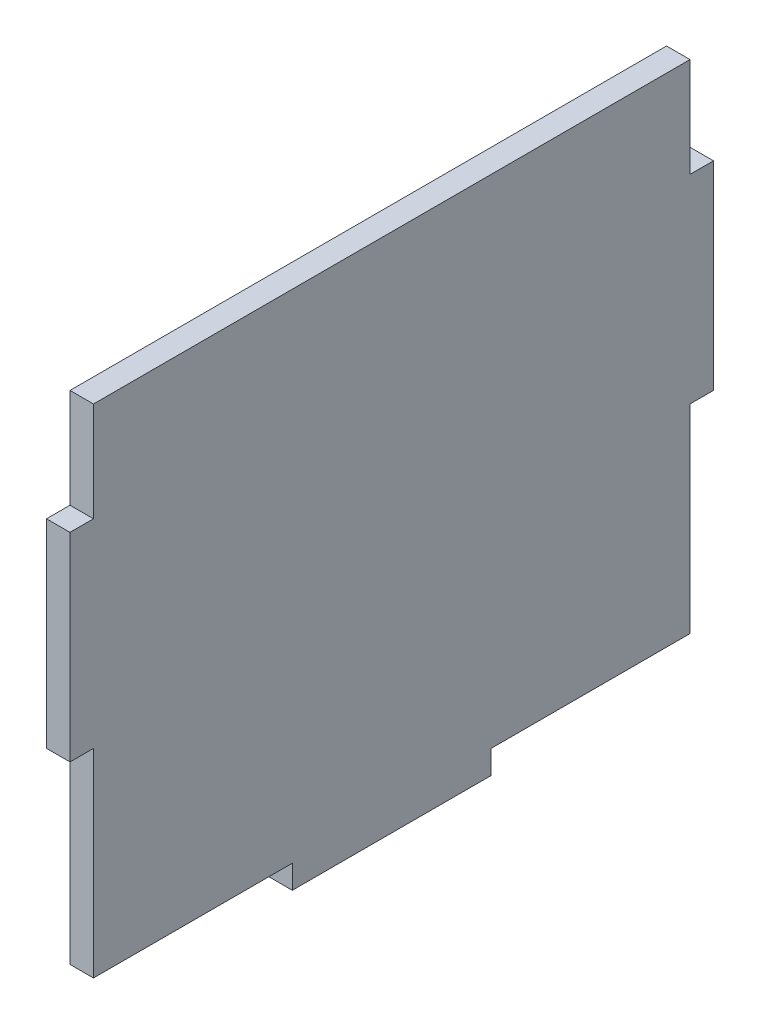
ISO-10303-21;
HEADER;
FILE_DESCRIPTION(('STEP AP214'),'2;1');
FILE_NAME('part.step','',(''),(''),'','','');
FILE_SCHEMA(('AUTOMOTIVE_DESIGN { 1 0 10303 214 1 1 1 1 }'));
ENDSEC;
DATA;
#1=APPLICATION_CONTEXT('core data for automotive mechanical design processes');
#2=APPLICATION_PROTOCOL_DEFINITION('international standard','automotive_design',2000,#1);
#3=PRODUCT_CONTEXT('',#1,'mechanical');
#4=PRODUCT('Part','Part','',(#3));
#5=PRODUCT_RELATED_PRODUCT_CATEGORY('part','',(#4));
#6=PRODUCT_DEFINITION_FORMATION('','',#4);
#7=PRODUCT_DEFINITION_CONTEXT('part definition',#1,'design');
#8=PRODUCT_DEFINITION('design','',#6,#7);
#9=PRODUCT_DEFINITION_SHAPE('','',#8);
#10=(LENGTH_UNIT() NAMED_UNIT(*) SI_UNIT(.MILLI.,.METRE.));
#11=(NAMED_UNIT(*) PLANE_ANGLE_UNIT() SI_UNIT($,.RADIAN.));
#12=(NAMED_UNIT(*) SI_UNIT($,.STERADIAN.) SOLID_ANGLE_UNIT());
#13=UNCERTAINTY_MEASURE_WITH_UNIT(LENGTH_MEASURE(1.E-05),#10,'distance_accuracy_value','');
#14=(GEOMETRIC_REPRESENTATION_CONTEXT(3) GLOBAL_UNCERTAINTY_ASSIGNED_CONTEXT((#13)) GLOBAL_UNIT_ASSIGNED_CONTEXT((#10,
#11,#12)) REPRESENTATION_CONTEXT('',''));
#15=CARTESIAN_POINT('',(0.,0.,0.));
#16=DIRECTION('',(0.,0.,1.));
#17=DIRECTION('',(1.,0.,0.));
#18=AXIS2_PLACEMENT_3D('',#15,#16,#17);
#19=CARTESIAN_POINT('',(3.,31.75,38.1));
#20=DIRECTION('',(0.,0.,-1.));
#21=DIRECTION('',(-1.,0.,0.));
#22=AXIS2_PLACEMENT_3D('',#19,#20,#21);
#23=PLANE('',#22);
#24=DIRECTION('',(0.,-1.,0.));
#25=VECTOR('',#24,1.);
#26=CARTESIAN_POINT('',(0.,31.75,38.1));
#27=LINE('',#26,#25);
#28=CARTESIAN_POINT('',(0.,31.75,38.1));
#29=VERTEX_POINT('',#28);
#30=CARTESIAN_POINT('',(0.,19.05,38.1));
#31=VERTEX_POINT('',#30);
#32=EDGE_CURVE('E177',#29,#31,#27,.T.);
#33=ORIENTED_EDGE('',*,*,#32,.T.);
#34=DIRECTION('',(-1.,0.,0.));
#35=VECTOR('',#34,1.);
#36=CARTESIAN_POINT('',(3.,19.05,38.1));
#37=LINE('',#36,#35);
#38=CARTESIAN_POINT('',(3.,19.05,38.1));
#39=VERTEX_POINT('',#38);
#40=EDGE_CURVE('E11',#39,#31,#37,.T.);
#41=ORIENTED_EDGE('',*,*,#40,.F.);
#42=DIRECTION('',(0.,-1.,0.));
#43=VECTOR('',#42,1.);
#44=CARTESIAN_POINT('',(3.,31.75,38.1));
#45=LINE('',#44,#43);
#46=CARTESIAN_POINT('',(3.,31.75,38.1));
#47=VERTEX_POINT('',#46);
#48=EDGE_CURVE('E209',#47,#39,#45,.T.);
#49=ORIENTED_EDGE('',*,*,#48,.F.);
#50=DIRECTION('',(-1.,0.,0.));
#51=VECTOR('',#50,1.);
#52=CARTESIAN_POINT('',(3.,31.75,38.1));
#53=LINE('',#52,#51);
#54=EDGE_CURVE('E173',#47,#29,#53,.T.);
#55=ORIENTED_EDGE('',*,*,#54,.T.);
#56=EDGE_LOOP('',(#33,#41,#49,#55));
#57=FACE_BOUND('',#56,.T.);
#58=ADVANCED_FACE('F33',(#57),#23,.F.);
#59=CARTESIAN_POINT('',(3.,19.05,38.1));
#60=DIRECTION('',(0.,-1.,0.));
#61=DIRECTION('',(0.,0.,-1.));
#62=AXIS2_PLACEMENT_3D('',#59,#60,#61);
#63=PLANE('',#62);
#64=DIRECTION('',(0.,0.,1.));
#65=VECTOR('',#64,1.);
#66=CARTESIAN_POINT('',(0.,19.05,38.1));
#67=LINE('',#66,#65);
#68=CARTESIAN_POINT('',(0.,19.05,41.1));
#69=VERTEX_POINT('',#68);
#70=EDGE_CURVE('E180',#31,#69,#67,.T.);
#71=ORIENTED_EDGE('',*,*,#70,.T.);
#72=DIRECTION('',(-1.,0.,0.));
#73=VECTOR('',#72,1.);
#74=CARTESIAN_POINT('',(3.,19.05,41.1));
#75=LINE('',#74,#73);
#76=CARTESIAN_POINT('',(3.,19.05,41.1));
#77=VERTEX_POINT('',#76);
#78=EDGE_CURVE('E41',#77,#69,#75,.T.);
#79=ORIENTED_EDGE('',*,*,#78,.F.);
#80=DIRECTION('',(0.,0.,1.));
#81=VECTOR('',#80,1.);
#82=CARTESIAN_POINT('',(3.,19.05,38.1));
#83=LINE('',#82,#81);
#84=EDGE_CURVE('E116',#39,#77,#83,.T.);
#85=ORIENTED_EDGE('',*,*,#84,.F.);
#86=ORIENTED_EDGE('',*,*,#40,.T.);
#87=EDGE_LOOP('',(#71,#79,#85,#86));
#88=FACE_BOUND('',#87,.T.);
#89=ADVANCED_FACE('F306',(#88),#63,.F.);
#90=CARTESIAN_POINT('',(3.,19.05,41.1));
#91=DIRECTION('',(0.,0.,-1.));
#92=DIRECTION('',(-1.,0.,0.));
#93=AXIS2_PLACEMENT_3D('',#90,#91,#92);
#94=PLANE('',#93);
#95=DIRECTION('',(0.,-1.,0.));
#96=VECTOR('',#95,1.);
#97=CARTESIAN_POINT('',(0.,19.05,41.1));
#98=LINE('',#97,#96);
#99=CARTESIAN_POINT('',(0.,-6.35,41.1));
#100=VERTEX_POINT('',#99);
#101=EDGE_CURVE('E182',#69,#100,#98,.T.);
#102=ORIENTED_EDGE('',*,*,#101,.T.);
#103=DIRECTION('',(-1.,0.,0.));
#104=VECTOR('',#103,1.);
#105=CARTESIAN_POINT('',(3.,-6.35,41.1));
#106=LINE('',#105,#104);
#107=CARTESIAN_POINT('',(3.,-6.35,41.1));
#108=VERTEX_POINT('',#107);
#109=EDGE_CURVE('E240',#108,#100,#106,.T.);
#110=ORIENTED_EDGE('',*,*,#109,.F.);
#111=DIRECTION('',(0.,-1.,0.));
#112=VECTOR('',#111,1.);
#113=CARTESIAN_POINT('',(3.,19.05,41.1));
#114=LINE('',#113,#112);
#115=EDGE_CURVE('E248',#77,#108,#114,.T.);
#116=ORIENTED_EDGE('',*,*,#115,.F.);
#117=ORIENTED_EDGE('',*,*,#78,.T.);
#118=EDGE_LOOP('',(#102,#110,#116,#117));
#119=FACE_BOUND('',#118,.T.);
#120=ADVANCED_FACE('F246',(#119),#94,.F.);
#121=CARTESIAN_POINT('',(3.,-6.35,38.1));
#122=DIRECTION('',(0.,1.,0.));
#123=DIRECTION('',(0.,0.,1.));
#124=AXIS2_PLACEMENT_3D('',#121,#122,#123);
#125=PLANE('',#124);
#126=DIRECTION('',(0.,0.,-1.));
#127=VECTOR('',#126,1.);
#128=CARTESIAN_POINT('',(0.,-6.35,38.1));
#129=LINE('',#128,#127);
#130=CARTESIAN_POINT('',(0.,-6.35,38.1));
#131=VERTEX_POINT('',#130);
#132=EDGE_CURVE('E184',#100,#131,#129,.T.);
#133=ORIENTED_EDGE('',*,*,#132,.T.);
#134=DIRECTION('',(-1.,0.,0.));
#135=VECTOR('',#134,1.);
#136=CARTESIAN_POINT('',(3.,-6.35,38.1));
#137=LINE('',#136,#135);
#138=CARTESIAN_POINT('',(3.,-6.35,38.1));
#139=VERTEX_POINT('',#138);
#140=EDGE_CURVE('E237',#139,#131,#137,.T.);
#141=ORIENTED_EDGE('',*,*,#140,.F.);
#142=DIRECTION('',(0.,0.,-1.));
#143=VECTOR('',#142,1.);
#144=CARTESIAN_POINT('',(3.,-6.35,38.1));
#145=LINE('',#144,#143);
#146=EDGE_CURVE('E265',#108,#139,#145,.T.);
#147=ORIENTED_EDGE('',*,*,#146,.F.);
#148=ORIENTED_EDGE('',*,*,#109,.T.);
#149=EDGE_LOOP('',(#133,#141,#147,#148));
#150=FACE_BOUND('',#149,.T.);
#151=ADVANCED_FACE('F256',(#150),#125,.F.);
#152=CARTESIAN_POINT('',(3.,-20.8153,38.1));
#153=DIRECTION('',(0.,0.,-1.));
#154=DIRECTION('',(0.,1.,0.));
#155=AXIS2_PLACEMENT_3D('',#152,#153,#154);
#156=PLANE('',#155);
#157=DIRECTION('',(0.,-1.,0.));
#158=VECTOR('',#157,1.);
#159=CARTESIAN_POINT('',(0.,-20.8153,38.1));
#160=LINE('',#159,#158);
#161=CARTESIAN_POINT('',(0.,-31.75,38.1));
#162=VERTEX_POINT('',#161);
#163=EDGE_CURVE('E187',#131,#162,#160,.T.);
#164=ORIENTED_EDGE('',*,*,#163,.T.);
#165=DIRECTION('',(-1.,0.,0.));
#166=VECTOR('',#165,1.);
#167=CARTESIAN_POINT('',(3.,-31.75,38.1));
#168=LINE('',#167,#166);
#169=CARTESIAN_POINT('',(3.,-31.75,38.1));
#170=VERTEX_POINT('',#169);
#171=EDGE_CURVE('E234',#170,#162,#168,.T.);
#172=ORIENTED_EDGE('',*,*,#171,.F.);
#173=DIRECTION('',(0.,-1.,0.));
#174=VECTOR('',#173,1.);
#175=CARTESIAN_POINT('',(3.,-6.35,38.1));
#176=LINE('',#175,#174);
#177=EDGE_CURVE('E262',#139,#170,#176,.T.);
#178=ORIENTED_EDGE('',*,*,#177,.F.);
#179=ORIENTED_EDGE('',*,*,#140,.T.);
#180=EDGE_LOOP('',(#164,#172,#178,#179));
#181=FACE_BOUND('',#180,.T.);
#182=ADVANCED_FACE('F260',(#181),#156,.F.);
#183=CARTESIAN_POINT('',(3.,-31.75,38.1));
#184=DIRECTION('',(0.,1.,0.));
#185=DIRECTION('',(0.,0.,1.));
#186=AXIS2_PLACEMENT_3D('',#183,#184,#185);
#187=PLANE('',#186);
#188=DIRECTION('',(0.,0.,-1.));
#189=VECTOR('',#188,1.);
#190=CARTESIAN_POINT('',(0.,-31.75,38.1));
#191=LINE('',#190,#189);
#192=CARTESIAN_POINT('',(0.,-31.75,12.7));
#193=VERTEX_POINT('',#192);
#194=EDGE_CURVE('E189',#162,#193,#191,.T.);
#195=ORIENTED_EDGE('',*,*,#194,.T.);
#196=DIRECTION('',(-1.,0.,0.));
#197=VECTOR('',#196,1.);
#198=CARTESIAN_POINT('',(3.,-31.75,12.7));
#199=LINE('',#198,#197);
#200=CARTESIAN_POINT('',(3.,-31.75,12.7));
#201=VERTEX_POINT('',#200);
#202=EDGE_CURVE('E231',#201,#193,#199,.T.);
#203=ORIENTED_EDGE('',*,*,#202,.F.);
#204=DIRECTION('',(0.,0.,-1.));
#205=VECTOR('',#204,1.);
#206=CARTESIAN_POINT('',(3.,-31.75,38.1));
#207=LINE('',#206,#205);
#208=EDGE_CURVE('E264',#170,#201,#207,.T.);
#209=ORIENTED_EDGE('',*,*,#208,.F.);
#210=ORIENTED_EDGE('',*,*,#171,.T.);
#211=EDGE_LOOP('',(#195,#203,#209,#210));
#212=FACE_BOUND('',#211,.T.);
#213=ADVANCED_FACE('F319',(#212),#187,.F.);
#214=CARTESIAN_POINT('',(3.,-31.75,12.7));
#215=DIRECTION('',(0.,0.,-1.));
#216=DIRECTION('',(-1.,0.,0.));
#217=AXIS2_PLACEMENT_3D('',#214,#215,#216);
#218=PLANE('',#217);
#219=DIRECTION('',(0.,-1.,0.));
#220=VECTOR('',#219,1.);
#221=CARTESIAN_POINT('',(0.,-31.75,12.7));
#222=LINE('',#221,#220);
#223=CARTESIAN_POINT('',(0.,-34.75,12.7));
#224=VERTEX_POINT('',#223);
#225=EDGE_CURVE('E191',#193,#224,#222,.T.);
#226=ORIENTED_EDGE('',*,*,#225,.T.);
#227=DIRECTION('',(-1.,0.,0.));
#228=VECTOR('',#227,1.);
#229=CARTESIAN_POINT('',(3.,-34.75,12.7));
#230=LINE('',#229,#228);
#231=CARTESIAN_POINT('',(3.,-34.75,12.7));
#232=VERTEX_POINT('',#231);
#233=EDGE_CURVE('E228',#232,#224,#230,.T.);
#234=ORIENTED_EDGE('',*,*,#233,.F.);
#235=DIRECTION('',(0.,-1.,0.));
#236=VECTOR('',#235,1.);
#237=CARTESIAN_POINT('',(3.,-31.75,12.7));
#238=LINE('',#237,#236);
#239=EDGE_CURVE('E267',#201,#232,#238,.T.);
#240=ORIENTED_EDGE('',*,*,#239,.F.);
#241=ORIENTED_EDGE('',*,*,#202,.T.);
#242=EDGE_LOOP('',(#226,#234,#240,#241));
#243=FACE_BOUND('',#242,.T.);
#244=ADVANCED_FACE('F322',(#243),#218,.F.);
#245=CARTESIAN_POINT('',(3.,-34.75,12.7));
#246=DIRECTION('',(0.,1.,0.));
#247=DIRECTION('',(0.,0.,1.));
#248=AXIS2_PLACEMENT_3D('',#245,#246,#247);
#249=PLANE('',#248);
#250=DIRECTION('',(0.,0.,-1.));
#251=VECTOR('',#250,1.);
#252=CARTESIAN_POINT('',(0.,-34.75,12.7));
#253=LINE('',#252,#251);
#254=CARTESIAN_POINT('',(0.,-34.75,-12.7));
#255=VERTEX_POINT('',#254);
#256=EDGE_CURVE('E193',#224,#255,#253,.T.);
#257=ORIENTED_EDGE('',*,*,#256,.T.);
#258=DIRECTION('',(-1.,0.,0.));
#259=VECTOR('',#258,1.);
#260=CARTESIAN_POINT('',(3.,-34.75,-12.7));
#261=LINE('',#260,#259);
#262=CARTESIAN_POINT('',(3.,-34.75,-12.7));
#263=VERTEX_POINT('',#262);
#264=EDGE_CURVE('E225',#263,#255,#261,.T.);
#265=ORIENTED_EDGE('',*,*,#264,.F.);
#266=DIRECTION('',(0.,0.,-1.));
#267=VECTOR('',#266,1.);
#268=CARTESIAN_POINT('',(3.,-34.75,12.7));
#269=LINE('',#268,#267);
#270=EDGE_CURVE('E273',#232,#263,#269,.T.);
#271=ORIENTED_EDGE('',*,*,#270,.F.);
#272=ORIENTED_EDGE('',*,*,#233,.T.);
#273=EDGE_LOOP('',(#257,#265,#271,#272));
#274=FACE_BOUND('',#273,.T.);
#275=ADVANCED_FACE('F326',(#274),#249,.F.);
#276=CARTESIAN_POINT('',(3.,-31.75,-12.7));
#277=DIRECTION('',(0.,0.,1.));
#278=DIRECTION('',(0.,-1.,0.));
#279=AXIS2_PLACEMENT_3D('',#276,#277,#278);
#280=PLANE('',#279);
#281=DIRECTION('',(0.,1.,0.));
#282=VECTOR('',#281,1.);
#283=CARTESIAN_POINT('',(0.,-31.75,-12.7));
#284=LINE('',#283,#282);
#285=CARTESIAN_POINT('',(0.,-31.75,-12.7));
#286=VERTEX_POINT('',#285);
#287=EDGE_CURVE('E195',#255,#286,#284,.T.);
#288=ORIENTED_EDGE('',*,*,#287,.T.);
#289=DIRECTION('',(-1.,0.,0.));
#290=VECTOR('',#289,1.);
#291=CARTESIAN_POINT('',(3.,-31.75,-12.7));
#292=LINE('',#291,#290);
#293=CARTESIAN_POINT('',(3.,-31.75,-12.7));
#294=VERTEX_POINT('',#293);
#295=EDGE_CURVE('E222',#294,#286,#292,.T.);
#296=ORIENTED_EDGE('',*,*,#295,.F.);
#297=DIRECTION('',(0.,1.,0.));
#298=VECTOR('',#297,1.);
#299=CARTESIAN_POINT('',(3.,-31.75,-12.7));
#300=LINE('',#299,#298);
#301=EDGE_CURVE('E275',#263,#294,#300,.T.);
#302=ORIENTED_EDGE('',*,*,#301,.F.);
#303=ORIENTED_EDGE('',*,*,#264,.T.);
#304=EDGE_LOOP('',(#288,#296,#302,#303));
#305=FACE_BOUND('',#304,.T.);
#306=ADVANCED_FACE('F330',(#305),#280,.F.);
#307=CARTESIAN_POINT('',(3.,-31.75,-12.7));
#308=DIRECTION('',(0.,1.,0.));
#309=DIRECTION('',(0.,0.,1.));
#310=AXIS2_PLACEMENT_3D('',#307,#308,#309);
#311=PLANE('',#310);
#312=DIRECTION('',(0.,0.,-1.));
#313=VECTOR('',#312,1.);
#314=CARTESIAN_POINT('',(0.,-31.75,-12.7));
#315=LINE('',#314,#313);
#316=CARTESIAN_POINT('',(0.,-31.75,-38.1));
#317=VERTEX_POINT('',#316);
#318=EDGE_CURVE('E197',#286,#317,#315,.T.);
#319=ORIENTED_EDGE('',*,*,#318,.T.);
#320=DIRECTION('',(-1.,0.,0.));
#321=VECTOR('',#320,1.);
#322=CARTESIAN_POINT('',(3.,-31.75,-38.1));
#323=LINE('',#322,#321);
#324=CARTESIAN_POINT('',(3.,-31.75,-38.1));
#325=VERTEX_POINT('',#324);
#326=EDGE_CURVE('E219',#325,#317,#323,.T.);
#327=ORIENTED_EDGE('',*,*,#326,.F.);
#328=DIRECTION('',(0.,0.,-1.));
#329=VECTOR('',#328,1.);
#330=CARTESIAN_POINT('',(3.,-31.75,-12.7));
#331=LINE('',#330,#329);
#332=EDGE_CURVE('E277',#294,#325,#331,.T.);
#333=ORIENTED_EDGE('',*,*,#332,.F.);
#334=ORIENTED_EDGE('',*,*,#295,.T.);
#335=EDGE_LOOP('',(#319,#327,#333,#334));
#336=FACE_BOUND('',#335,.T.);
#337=ADVANCED_FACE('F334',(#336),#311,.F.);
#338=CARTESIAN_POINT('',(3.,-6.35,-38.1));
#339=DIRECTION('',(0.,0.,1.));
#340=DIRECTION('',(0.,-1.,0.));
#341=AXIS2_PLACEMENT_3D('',#338,#339,#340);
#342=PLANE('',#341);
#343=DIRECTION('',(0.,1.,0.));
#344=VECTOR('',#343,1.);
#345=CARTESIAN_POINT('',(0.,-6.35,-38.1));
#346=LINE('',#345,#344);
#347=CARTESIAN_POINT('',(0.,-6.35,-38.1));
#348=VERTEX_POINT('',#347);
#349=EDGE_CURVE('E200',#317,#348,#346,.T.);
#350=ORIENTED_EDGE('',*,*,#349,.T.);
#351=DIRECTION('',(-1.,0.,0.));
#352=VECTOR('',#351,1.);
#353=CARTESIAN_POINT('',(3.,-6.35,-38.1));
#354=LINE('',#353,#352);
#355=CARTESIAN_POINT('',(3.,-6.35,-38.1));
#356=VERTEX_POINT('',#355);
#357=EDGE_CURVE('E216',#356,#348,#354,.T.);
#358=ORIENTED_EDGE('',*,*,#357,.F.);
#359=DIRECTION('',(0.,1.,0.));
#360=VECTOR('',#359,1.);
#361=CARTESIAN_POINT('',(3.,-20.8153,-38.1));
#362=LINE('',#361,#360);
#363=EDGE_CURVE('E279',#325,#356,#362,.T.);
#364=ORIENTED_EDGE('',*,*,#363,.F.);
#365=ORIENTED_EDGE('',*,*,#326,.T.);
#366=EDGE_LOOP('',(#350,#358,#364,#365));
#367=FACE_BOUND('',#366,.T.);
#368=ADVANCED_FACE('F338',(#367),#342,.F.);
#369=CARTESIAN_POINT('',(3.,-6.35,-38.1));
#370=DIRECTION('',(0.,1.,0.));
#371=DIRECTION('',(0.,0.,1.));
#372=AXIS2_PLACEMENT_3D('',#369,#370,#371);
#373=PLANE('',#372);
#374=DIRECTION('',(0.,0.,-1.));
#375=VECTOR('',#374,1.);
#376=CARTESIAN_POINT('',(0.,-6.35,-38.1));
#377=LINE('',#376,#375);
#378=CARTESIAN_POINT('',(0.,-6.35,-41.1));
#379=VERTEX_POINT('',#378);
#380=EDGE_CURVE('E202',#348,#379,#377,.T.);
#381=ORIENTED_EDGE('',*,*,#380,.T.);
#382=DIRECTION('',(-1.,0.,0.));
#383=VECTOR('',#382,1.);
#384=CARTESIAN_POINT('',(3.,-6.35,-41.1));
#385=LINE('',#384,#383);
#386=CARTESIAN_POINT('',(3.,-6.35,-41.1));
#387=VERTEX_POINT('',#386);
#388=EDGE_CURVE('E213',#387,#379,#385,.T.);
#389=ORIENTED_EDGE('',*,*,#388,.F.);
#390=DIRECTION('',(0.,0.,-1.));
#391=VECTOR('',#390,1.);
#392=CARTESIAN_POINT('',(3.,-6.35,-38.1));
#393=LINE('',#392,#391);
#394=EDGE_CURVE('E281',#356,#387,#393,.T.);
#395=ORIENTED_EDGE('',*,*,#394,.F.);
#396=ORIENTED_EDGE('',*,*,#357,.T.);
#397=EDGE_LOOP('',(#381,#389,#395,#396));
#398=FACE_BOUND('',#397,.T.);
#399=ADVANCED_FACE('F287',(#398),#373,.F.);
#400=CARTESIAN_POINT('',(3.,19.05,-41.1));
#401=DIRECTION('',(0.,0.,1.));
#402=DIRECTION('',(1.,0.,0.));
#403=AXIS2_PLACEMENT_3D('',#400,#401,#402);
#404=PLANE('',#403);
#405=DIRECTION('',(0.,1.,0.));
#406=VECTOR('',#405,1.);
#407=CARTESIAN_POINT('',(0.,19.05,-41.1));
#408=LINE('',#407,#406);
#409=CARTESIAN_POINT('',(0.,19.05,-41.1));
#410=VERTEX_POINT('',#409);
#411=EDGE_CURVE('E204',#379,#410,#408,.T.);
#412=ORIENTED_EDGE('',*,*,#411,.T.);
#413=DIRECTION('',(-1.,0.,0.));
#414=VECTOR('',#413,1.);
#415=CARTESIAN_POINT('',(3.,19.05,-41.1));
#416=LINE('',#415,#414);
#417=CARTESIAN_POINT('',(3.,19.05,-41.1));
#418=VERTEX_POINT('',#417);
#419=EDGE_CURVE('E168',#418,#410,#416,.T.);
#420=ORIENTED_EDGE('',*,*,#419,.F.);
#421=DIRECTION('',(0.,1.,0.));
#422=VECTOR('',#421,1.);
#423=CARTESIAN_POINT('',(3.,19.05,-41.1));
#424=LINE('',#423,#422);
#425=EDGE_CURVE('E159',#387,#418,#424,.T.);
#426=ORIENTED_EDGE('',*,*,#425,.F.);
#427=ORIENTED_EDGE('',*,*,#388,.T.);
#428=EDGE_LOOP('',(#412,#420,#426,#427));
#429=FACE_BOUND('',#428,.T.);
#430=ADVANCED_FACE('F291',(#429),#404,.F.);
#431=CARTESIAN_POINT('',(3.,19.05,-38.1));
#432=DIRECTION('',(0.,-1.,0.));
#433=DIRECTION('',(0.,0.,-1.));
#434=AXIS2_PLACEMENT_3D('',#431,#432,#433);
#435=PLANE('',#434);
#436=DIRECTION('',(0.,0.,1.));
#437=VECTOR('',#436,1.);
#438=CARTESIAN_POINT('',(0.,19.05,-38.1));
#439=LINE('',#438,#437);
#440=CARTESIAN_POINT('',(0.,19.05,-38.1));
#441=VERTEX_POINT('',#440);
#442=EDGE_CURVE('E167',#410,#441,#439,.T.);
#443=ORIENTED_EDGE('',*,*,#442,.T.);
#444=DIRECTION('',(-1.,0.,0.));
#445=VECTOR('',#444,1.);
#446=CARTESIAN_POINT('',(3.,19.05,-38.1));
#447=LINE('',#446,#445);
#448=CARTESIAN_POINT('',(3.,19.05,-38.1));
#449=VERTEX_POINT('',#448);
#450=EDGE_CURVE('E164',#449,#441,#447,.T.);
#451=ORIENTED_EDGE('',*,*,#450,.F.);
#452=DIRECTION('',(0.,0.,1.));
#453=VECTOR('',#452,1.);
#454=CARTESIAN_POINT('',(3.,19.05,-38.1));
#455=LINE('',#454,#453);
#456=EDGE_CURVE('E153',#418,#449,#455,.T.);
#457=ORIENTED_EDGE('',*,*,#456,.F.);
#458=ORIENTED_EDGE('',*,*,#419,.T.);
#459=EDGE_LOOP('',(#443,#451,#457,#458));
#460=FACE_BOUND('',#459,.T.);
#461=ADVANCED_FACE('F165',(#460),#435,.F.);
#462=CARTESIAN_POINT('',(3.,31.75,-38.1));
#463=DIRECTION('',(0.,0.,1.));
#464=DIRECTION('',(0.,-1.,0.));
#465=AXIS2_PLACEMENT_3D('',#462,#463,#464);
#466=PLANE('',#465);
#467=DIRECTION('',(0.,1.,0.));
#468=VECTOR('',#467,1.);
#469=CARTESIAN_POINT('',(0.,31.75,-38.1));
#470=LINE('',#469,#468);
#471=CARTESIAN_POINT('',(0.,31.75,-38.1));
#472=VERTEX_POINT('',#471);
#473=EDGE_CURVE('E102',#441,#472,#470,.T.);
#474=ORIENTED_EDGE('',*,*,#473,.T.);
#475=DIRECTION('',(-1.,0.,0.));
#476=VECTOR('',#475,1.);
#477=CARTESIAN_POINT('',(3.,31.75,-38.1));
#478=LINE('',#477,#476);
#479=CARTESIAN_POINT('',(3.,31.75,-38.1));
#480=VERTEX_POINT('',#479);
#481=EDGE_CURVE('E169',#480,#472,#478,.T.);
#482=ORIENTED_EDGE('',*,*,#481,.F.);
#483=DIRECTION('',(0.,1.,0.));
#484=VECTOR('',#483,1.);
#485=CARTESIAN_POINT('',(3.,31.75,-38.1));
#486=LINE('',#485,#484);
#487=EDGE_CURVE('E157',#449,#480,#486,.T.);
#488=ORIENTED_EDGE('',*,*,#487,.F.);
#489=ORIENTED_EDGE('',*,*,#450,.T.);
#490=EDGE_LOOP('',(#474,#482,#488,#489));
#491=FACE_BOUND('',#490,.T.);
#492=ADVANCED_FACE('F171',(#491),#466,.F.);
#493=CARTESIAN_POINT('',(3.,31.75,38.1));
#494=DIRECTION('',(0.,-1.,0.));
#495=DIRECTION('',(0.,0.,-1.));
#496=AXIS2_PLACEMENT_3D('',#493,#494,#495);
#497=PLANE('',#496);
#498=DIRECTION('',(0.,0.,1.));
#499=VECTOR('',#498,1.);
#500=CARTESIAN_POINT('',(0.,31.75,38.1));
#501=LINE('',#500,#499);
#502=EDGE_CURVE('E108',#472,#29,#501,.T.);
#503=ORIENTED_EDGE('',*,*,#502,.T.);
#504=ORIENTED_EDGE('',*,*,#54,.F.);
#505=DIRECTION('',(0.,0.,1.));
#506=VECTOR('',#505,1.);
#507=CARTESIAN_POINT('',(3.,31.75,38.1));
#508=LINE('',#507,#506);
#509=EDGE_CURVE('E49',#480,#47,#508,.T.);
#510=ORIENTED_EDGE('',*,*,#509,.F.);
#511=ORIENTED_EDGE('',*,*,#481,.T.);
#512=EDGE_LOOP('',(#503,#504,#510,#511));
#513=FACE_BOUND('',#512,.T.);
#514=ADVANCED_FACE('F295',(#513),#497,.F.);
#515=CARTESIAN_POINT('',(3.,0.,0.));
#516=DIRECTION('',(-1.,0.,0.));
#517=DIRECTION('',(0.,0.,1.));
#518=AXIS2_PLACEMENT_3D('',#515,#516,#517);
#519=PLANE('',#518);
#520=ORIENTED_EDGE('',*,*,#48,.T.);
#521=ORIENTED_EDGE('',*,*,#84,.T.);
#522=ORIENTED_EDGE('',*,*,#115,.T.);
#523=ORIENTED_EDGE('',*,*,#146,.T.);
#524=ORIENTED_EDGE('',*,*,#177,.T.);
#525=ORIENTED_EDGE('',*,*,#208,.T.);
#526=ORIENTED_EDGE('',*,*,#239,.T.);
#527=ORIENTED_EDGE('',*,*,#270,.T.);
#528=ORIENTED_EDGE('',*,*,#301,.T.);
#529=ORIENTED_EDGE('',*,*,#332,.T.);
#530=ORIENTED_EDGE('',*,*,#363,.T.);
#531=ORIENTED_EDGE('',*,*,#394,.T.);
#532=ORIENTED_EDGE('',*,*,#425,.T.);
#533=ORIENTED_EDGE('',*,*,#456,.T.);
#534=ORIENTED_EDGE('',*,*,#487,.T.);
#535=ORIENTED_EDGE('',*,*,#509,.T.);
#536=EDGE_LOOP('',(#520,#521,#522,#523,#524,#525,#526,#527,#528,#529,#530,#531,#532,#533,#534,#535));
#537=FACE_BOUND('',#536,.T.);
#538=ADVANCED_FACE('F155',(#537),#519,.F.);
#539=CARTESIAN_POINT('',(0.,0.,0.));
#540=DIRECTION('',(-1.,0.,0.));
#541=DIRECTION('',(0.,0.,1.));
#542=AXIS2_PLACEMENT_3D('',#539,#540,#541);
#543=PLANE('',#542);
#544=ORIENTED_EDGE('',*,*,#32,.F.);
#545=ORIENTED_EDGE('',*,*,#502,.F.);
#546=ORIENTED_EDGE('',*,*,#473,.F.);
#547=ORIENTED_EDGE('',*,*,#442,.F.);
#548=ORIENTED_EDGE('',*,*,#411,.F.);
#549=ORIENTED_EDGE('',*,*,#380,.F.);
#550=ORIENTED_EDGE('',*,*,#349,.F.);
#551=ORIENTED_EDGE('',*,*,#318,.F.);
#552=ORIENTED_EDGE('',*,*,#287,.F.);
#553=ORIENTED_EDGE('',*,*,#256,.F.);
#554=ORIENTED_EDGE('',*,*,#225,.F.);
#555=ORIENTED_EDGE('',*,*,#194,.F.);
#556=ORIENTED_EDGE('',*,*,#163,.F.);
#557=ORIENTED_EDGE('',*,*,#132,.F.);
#558=ORIENTED_EDGE('',*,*,#101,.F.);
#559=ORIENTED_EDGE('',*,*,#70,.F.);
#560=EDGE_LOOP('',(#544,#545,#546,#547,#548,#549,#550,#551,#552,#553,#554,#555,#556,#557,#558,#559));
#561=FACE_BOUND('',#560,.T.);
#562=ADVANCED_FACE('F252',(#561),#543,.T.);
#563=CLOSED_SHELL('',(#58,#89,#120,#151,#182,#213,#244,#275,#306,#337,#368,#399,#430,#461,#492,
#514,#538,#562));
#564=MANIFOLD_SOLID_BREP('B2',#563);
#565=ADVANCED_BREP_SHAPE_REPRESENTATION('',(#18,#564),#14);
#566=SHAPE_DEFINITION_REPRESENTATION(#9,#565);
ENDSEC;
END-ISO-10303-21;
